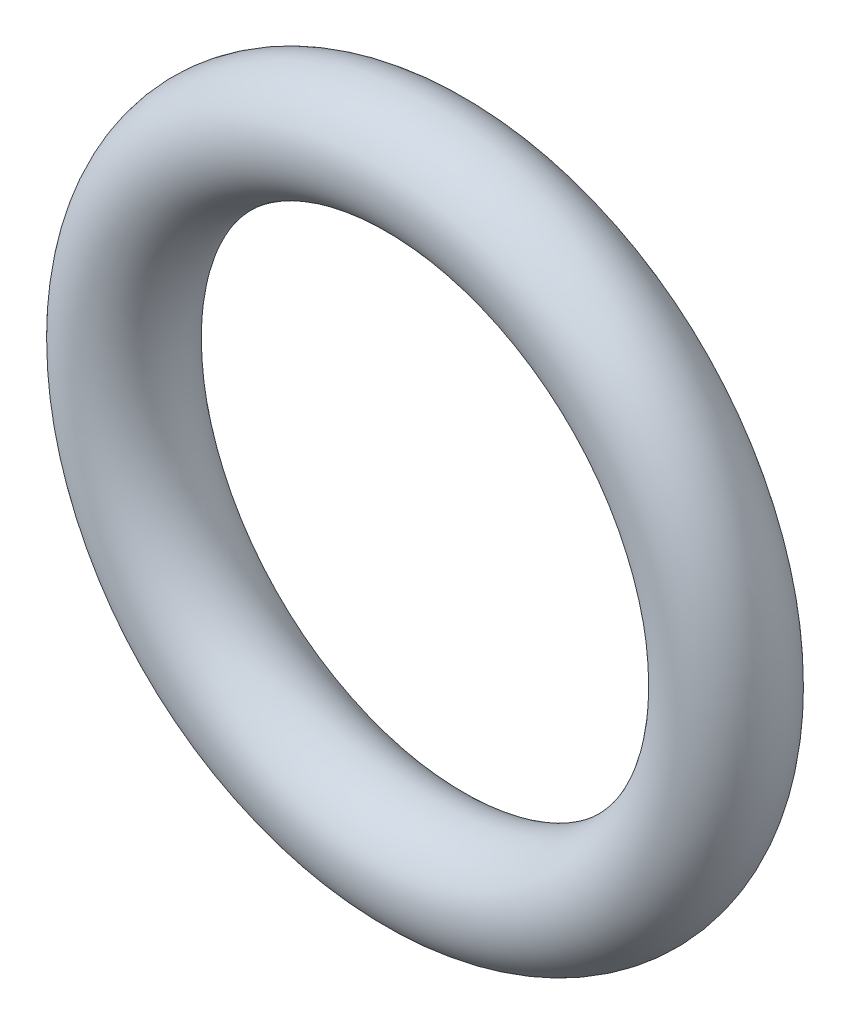
ISO-10303-21;
HEADER;
FILE_DESCRIPTION(('STEP AP214'),'2;1');
FILE_NAME('part.step','',(''),(''),'','','');
FILE_SCHEMA(('AUTOMOTIVE_DESIGN { 1 0 10303 214 1 1 1 1 }'));
ENDSEC;
DATA;
#1=APPLICATION_CONTEXT('core data for automotive mechanical design processes');
#2=APPLICATION_PROTOCOL_DEFINITION('international standard','automotive_design',2000,#1);
#3=PRODUCT_CONTEXT('',#1,'mechanical');
#4=PRODUCT('Part','Part','',(#3));
#5=PRODUCT_RELATED_PRODUCT_CATEGORY('part','',(#4));
#6=PRODUCT_DEFINITION_FORMATION('','',#4);
#7=PRODUCT_DEFINITION_CONTEXT('part definition',#1,'design');
#8=PRODUCT_DEFINITION('design','',#6,#7);
#9=PRODUCT_DEFINITION_SHAPE('','',#8);
#10=(LENGTH_UNIT() NAMED_UNIT(*) SI_UNIT(.MILLI.,.METRE.));
#11=(NAMED_UNIT(*) PLANE_ANGLE_UNIT() SI_UNIT($,.RADIAN.));
#12=(NAMED_UNIT(*) SI_UNIT($,.STERADIAN.) SOLID_ANGLE_UNIT());
#13=UNCERTAINTY_MEASURE_WITH_UNIT(LENGTH_MEASURE(1.E-05),#10,'distance_accuracy_value','');
#14=(GEOMETRIC_REPRESENTATION_CONTEXT(3) GLOBAL_UNCERTAINTY_ASSIGNED_CONTEXT((#13)) GLOBAL_UNIT_ASSIGNED_CONTEXT((#10,
#11,#12)) REPRESENTATION_CONTEXT('',''));
#15=CARTESIAN_POINT('',(0.,0.,0.));
#16=DIRECTION('',(0.,0.,1.));
#17=DIRECTION('',(1.,0.,0.));
#18=AXIS2_PLACEMENT_3D('',#15,#16,#17);
#19=CARTESIAN_POINT('',(0.,0.,0.));
#20=DIRECTION('',(0.,0.,-1.));
#21=DIRECTION('',(-1.,0.,0.));
#22=AXIS2_PLACEMENT_3D('',#19,#20,#21);
#23=TOROIDAL_SURFACE('',#22,2.75,0.5);
#24=CARTESIAN_POINT('',(-3.25,0.,0.));
#25=VERTEX_POINT('',#24);
#26=VERTEX_LOOP('',#25);
#27=FACE_BOUND('',#26,.T.);
#28=ADVANCED_FACE('F37',(#27),#23,.T.);
#29=CLOSED_SHELL('',(#28));
#30=MANIFOLD_SOLID_BREP('B2',#29);
#31=ADVANCED_BREP_SHAPE_REPRESENTATION('',(#18,#30),#14);
#32=SHAPE_DEFINITION_REPRESENTATION(#9,#31);
ENDSEC;
END-ISO-10303-21;
